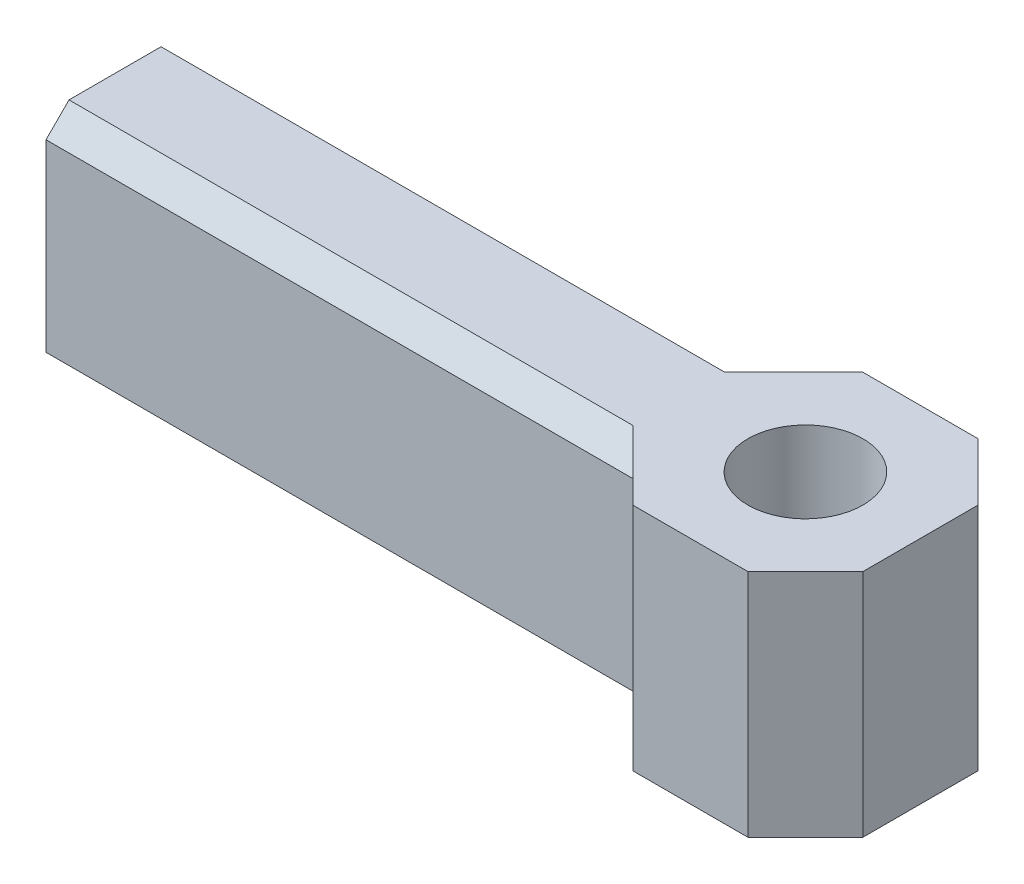
ISO-10303-21;
HEADER;
FILE_DESCRIPTION(('STEP AP214'),'2;1');
FILE_NAME('part.step','',(''),(''),'','','');
FILE_SCHEMA(('AUTOMOTIVE_DESIGN { 1 0 10303 214 1 1 1 1 }'));
ENDSEC;
DATA;
#1=APPLICATION_CONTEXT('core data for automotive mechanical design processes');
#2=APPLICATION_PROTOCOL_DEFINITION('international standard','automotive_design',2000,#1);
#3=PRODUCT_CONTEXT('',#1,'mechanical');
#4=PRODUCT('Part','Part','',(#3));
#5=PRODUCT_RELATED_PRODUCT_CATEGORY('part','',(#4));
#6=PRODUCT_DEFINITION_FORMATION('','',#4);
#7=PRODUCT_DEFINITION_CONTEXT('part definition',#1,'design');
#8=PRODUCT_DEFINITION('design','',#6,#7);
#9=PRODUCT_DEFINITION_SHAPE('','',#8);
#10=(LENGTH_UNIT() NAMED_UNIT(*) SI_UNIT(.MILLI.,.METRE.));
#11=(NAMED_UNIT(*) PLANE_ANGLE_UNIT() SI_UNIT($,.RADIAN.));
#12=(NAMED_UNIT(*) SI_UNIT($,.STERADIAN.) SOLID_ANGLE_UNIT());
#13=UNCERTAINTY_MEASURE_WITH_UNIT(LENGTH_MEASURE(1.E-05),#10,'distance_accuracy_value','');
#14=(GEOMETRIC_REPRESENTATION_CONTEXT(3) GLOBAL_UNCERTAINTY_ASSIGNED_CONTEXT((#13)) GLOBAL_UNIT_ASSIGNED_CONTEXT((#10,
#11,#12)) REPRESENTATION_CONTEXT('',''));
#15=CARTESIAN_POINT('',(0.,0.,0.));
#16=DIRECTION('',(0.,0.,1.));
#17=DIRECTION('',(1.,0.,0.));
#18=AXIS2_PLACEMENT_3D('',#15,#16,#17);
#19=CARTESIAN_POINT('',(5.,10.,5.));
#20=DIRECTION('',(-1.,0.,0.));
#21=DIRECTION('',(0.,0.,1.));
#22=AXIS2_PLACEMENT_3D('',#19,#20,#21);
#23=PLANE('',#22);
#24=DIRECTION('',(0.,0.,-1.));
#25=VECTOR('',#24,1.);
#26=CARTESIAN_POINT('',(5.,0.,5.));
#27=LINE('',#26,#25);
#28=CARTESIAN_POINT('',(5.,0.,2.5));
#29=VERTEX_POINT('',#28);
#30=CARTESIAN_POINT('',(5.,0.,-2.49999999999999));
#31=VERTEX_POINT('',#30);
#32=EDGE_CURVE('E162',#29,#31,#27,.T.);
#33=ORIENTED_EDGE('',*,*,#32,.T.);
#34=DIRECTION('',(0.,1.,0.));
#35=VECTOR('',#34,1.);
#36=CARTESIAN_POINT('',(5.,10.,-2.49999999999999));
#37=LINE('',#36,#35);
#38=CARTESIAN_POINT('',(5.,10.,-2.49999999999999));
#39=VERTEX_POINT('',#38);
#40=EDGE_CURVE('E139',#31,#39,#37,.T.);
#41=ORIENTED_EDGE('',*,*,#40,.T.);
#42=DIRECTION('',(0.,0.,-1.));
#43=VECTOR('',#42,1.);
#44=CARTESIAN_POINT('',(5.,10.,5.));
#45=LINE('',#44,#43);
#46=CARTESIAN_POINT('',(5.,10.,2.5));
#47=VERTEX_POINT('',#46);
#48=EDGE_CURVE('E173',#47,#39,#45,.T.);
#49=ORIENTED_EDGE('',*,*,#48,.F.);
#50=DIRECTION('',(0.,-1.,0.));
#51=VECTOR('',#50,1.);
#52=CARTESIAN_POINT('',(5.,10.,2.5));
#53=LINE('',#52,#51);
#54=EDGE_CURVE('E144',#47,#29,#53,.T.);
#55=ORIENTED_EDGE('',*,*,#54,.T.);
#56=EDGE_LOOP('',(#33,#41,#49,#55));
#57=FACE_BOUND('',#56,.T.);
#58=ADVANCED_FACE('F33',(#57),#23,.F.);
#59=CARTESIAN_POINT('',(-5.,10.,-5.));
#60=DIRECTION('',(0.,0.,1.));
#61=DIRECTION('',(1.,0.,0.));
#62=AXIS2_PLACEMENT_3D('',#59,#60,#61);
#63=PLANE('',#62);
#64=DIRECTION('',(-1.,0.,0.));
#65=VECTOR('',#64,1.);
#66=CARTESIAN_POINT('',(-5.,10.,-5.));
#67=LINE('',#66,#65);
#68=CARTESIAN_POINT('',(2.5,10.,-5.));
#69=VERTEX_POINT('',#68);
#70=CARTESIAN_POINT('',(-2.49999999999999,10.,-5.));
#71=VERTEX_POINT('',#70);
#72=EDGE_CURVE('E155',#69,#71,#67,.T.);
#73=ORIENTED_EDGE('',*,*,#72,.F.);
#74=DIRECTION('',(0.,-1.,0.));
#75=VECTOR('',#74,1.);
#76=CARTESIAN_POINT('',(2.5,10.,-5.));
#77=LINE('',#76,#75);
#78=CARTESIAN_POINT('',(2.5,0.,-5.));
#79=VERTEX_POINT('',#78);
#80=EDGE_CURVE('E138',#69,#79,#77,.T.);
#81=ORIENTED_EDGE('',*,*,#80,.T.);
#82=DIRECTION('',(-1.,0.,0.));
#83=VECTOR('',#82,1.);
#84=CARTESIAN_POINT('',(-5.,0.,-5.));
#85=LINE('',#84,#83);
#86=CARTESIAN_POINT('',(-2.49999999999999,0.,-5.));
#87=VERTEX_POINT('',#86);
#88=EDGE_CURVE('E152',#79,#87,#85,.T.);
#89=ORIENTED_EDGE('',*,*,#88,.T.);
#90=DIRECTION('',(0.,1.,0.));
#91=VECTOR('',#90,1.);
#92=CARTESIAN_POINT('',(-2.49999999999999,10.,-5.));
#93=LINE('',#92,#91);
#94=EDGE_CURVE('E157',#87,#71,#93,.T.);
#95=ORIENTED_EDGE('',*,*,#94,.T.);
#96=EDGE_LOOP('',(#73,#81,#89,#95));
#97=FACE_BOUND('',#96,.T.);
#98=ADVANCED_FACE('F150',(#97),#63,.F.);
#99=CARTESIAN_POINT('',(-5.00000000000001,10.,-3.));
#100=DIRECTION('',(0.,0.,1.));
#101=DIRECTION('',(1.,0.,0.));
#102=AXIS2_PLACEMENT_3D('',#99,#100,#101);
#103=PLANE('',#102);
#104=DIRECTION('',(0.,1.,0.));
#105=VECTOR('',#104,1.);
#106=CARTESIAN_POINT('',(-4.49999999999997,10.,-3.));
#107=LINE('',#106,#105);
#108=CARTESIAN_POINT('',(-4.49999999999997,8.99999999999999,-3.));
#109=VERTEX_POINT('',#108);
#110=CARTESIAN_POINT('',(-4.49999999999997,0.999999999999997,-3.));
#111=VERTEX_POINT('',#110);
#112=EDGE_CURVE('E205',#109,#111,#107,.F.);
#113=ORIENTED_EDGE('',*,*,#112,.T.);
#114=DIRECTION('',(-1.,0.,0.));
#115=VECTOR('',#114,1.);
#116=CARTESIAN_POINT('',(-30.,0.999999999999997,-3.));
#117=LINE('',#116,#115);
#118=CARTESIAN_POINT('',(-30.,0.999999999999997,-3.));
#119=VERTEX_POINT('',#118);
#120=EDGE_CURVE('E231',#111,#119,#117,.T.);
#121=ORIENTED_EDGE('',*,*,#120,.T.);
#122=DIRECTION('',(0.,-1.,0.));
#123=VECTOR('',#122,1.);
#124=CARTESIAN_POINT('',(-30.,10.,-3.));
#125=LINE('',#124,#123);
#126=CARTESIAN_POINT('',(-30.,8.99999999999999,-3.));
#127=VERTEX_POINT('',#126);
#128=EDGE_CURVE('E177',#127,#119,#125,.T.);
#129=ORIENTED_EDGE('',*,*,#128,.F.);
#130=DIRECTION('',(1.,0.,0.));
#131=VECTOR('',#130,1.);
#132=CARTESIAN_POINT('',(-5.00000000000001,8.99999999999999,-3.));
#133=LINE('',#132,#131);
#134=EDGE_CURVE('E54',#127,#109,#133,.T.);
#135=ORIENTED_EDGE('',*,*,#134,.T.);
#136=EDGE_LOOP('',(#113,#121,#129,#135));
#137=FACE_BOUND('',#136,.T.);
#138=ADVANCED_FACE('F288',(#137),#103,.F.);
#139=CARTESIAN_POINT('',(-30.,10.,-3.));
#140=DIRECTION('',(1.,0.,0.));
#141=DIRECTION('',(0.,0.,-1.));
#142=AXIS2_PLACEMENT_3D('',#139,#140,#141);
#143=PLANE('',#142);
#144=CARTESIAN_POINT('',(-30.,5.,0.));
#145=DIRECTION('',(-1.,0.,0.));
#146=DIRECTION('',(0.,0.,1.));
#147=AXIS2_PLACEMENT_3D('',#144,#145,#146);
#148=CIRCLE('',#147,1.7);
#149=CARTESIAN_POINT('',(-30.,5.,1.7));
#150=VERTEX_POINT('',#149);
#151=EDGE_CURVE('E272',#150,#150,#148,.T.);
#152=ORIENTED_EDGE('',*,*,#151,.F.);
#153=EDGE_LOOP('',(#152));
#154=FACE_BOUND('',#153,.T.);
#155=DIRECTION('',(0.,0.,1.));
#156=VECTOR('',#155,1.);
#157=CARTESIAN_POINT('',(-30.,0.,-3.));
#158=LINE('',#157,#156);
#159=CARTESIAN_POINT('',(-30.,0.,-1.99999999999999));
#160=VERTEX_POINT('',#159);
#161=CARTESIAN_POINT('',(-30.,0.,2.));
#162=VERTEX_POINT('',#161);
#163=EDGE_CURVE('E161',#160,#162,#158,.T.);
#164=ORIENTED_EDGE('',*,*,#163,.T.);
#165=DIRECTION('',(0.,0.707106781186546,0.707106781186549));
#166=VECTOR('',#165,1.);
#167=CARTESIAN_POINT('',(-30.,1.,3.00000000000001));
#168=LINE('',#167,#166);
#169=CARTESIAN_POINT('',(-30.,1.,3.00000000000001));
#170=VERTEX_POINT('',#169);
#171=EDGE_CURVE('E222',#162,#170,#168,.T.);
#172=ORIENTED_EDGE('',*,*,#171,.T.);
#173=DIRECTION('',(0.,-1.,0.));
#174=VECTOR('',#173,1.);
#175=CARTESIAN_POINT('',(-30.,10.,3.00000000000001));
#176=LINE('',#175,#174);
#177=CARTESIAN_POINT('',(-30.,8.99999999999999,3.00000000000001));
#178=VERTEX_POINT('',#177);
#179=EDGE_CURVE('E174',#178,#170,#176,.T.);
#180=ORIENTED_EDGE('',*,*,#179,.F.);
#181=DIRECTION('',(0.,-0.707106781186549,0.707106781186546));
#182=VECTOR('',#181,1.);
#183=CARTESIAN_POINT('',(-30.,10.,2.));
#184=LINE('',#183,#182);
#185=CARTESIAN_POINT('',(-30.,10.,2.));
#186=VERTEX_POINT('',#185);
#187=EDGE_CURVE('E220',#178,#186,#184,.F.);
#188=ORIENTED_EDGE('',*,*,#187,.T.);
#189=DIRECTION('',(0.,0.,1.));
#190=VECTOR('',#189,1.);
#191=CARTESIAN_POINT('',(-30.,10.,-3.));
#192=LINE('',#191,#190);
#193=CARTESIAN_POINT('',(-30.,10.,-1.99999999999999));
#194=VERTEX_POINT('',#193);
#195=EDGE_CURVE('E256',#194,#186,#192,.T.);
#196=ORIENTED_EDGE('',*,*,#195,.F.);
#197=DIRECTION('',(0.,0.707106781186549,0.707106781186546));
#198=VECTOR('',#197,1.);
#199=CARTESIAN_POINT('',(-30.,10.,-1.99999999999999));
#200=LINE('',#199,#198);
#201=EDGE_CURVE('E216',#194,#127,#200,.F.);
#202=ORIENTED_EDGE('',*,*,#201,.T.);
#203=ORIENTED_EDGE('',*,*,#128,.T.);
#204=DIRECTION('',(0.,-0.707106781186545,0.70710678118655));
#205=VECTOR('',#204,1.);
#206=CARTESIAN_POINT('',(-30.,0.999999999999997,-3.));
#207=LINE('',#206,#205);
#208=EDGE_CURVE('E218',#119,#160,#207,.T.);
#209=ORIENTED_EDGE('',*,*,#208,.T.);
#210=EDGE_LOOP('',(#164,#172,#180,#188,#196,#202,#203,#209));
#211=FACE_BOUND('',#210,.T.);
#212=ADVANCED_FACE('F255',(#154,#211),#143,.F.);
#213=CARTESIAN_POINT('',(-30.,10.,3.00000000000001));
#214=DIRECTION('',(0.,0.,-1.));
#215=DIRECTION('',(-1.,0.,0.));
#216=AXIS2_PLACEMENT_3D('',#213,#214,#215);
#217=PLANE('',#216);
#218=ORIENTED_EDGE('',*,*,#179,.T.);
#219=DIRECTION('',(1.,0.,0.));
#220=VECTOR('',#219,1.);
#221=CARTESIAN_POINT('',(-4.49999999999998,1.,3.));
#222=LINE('',#221,#220);
#223=CARTESIAN_POINT('',(-4.49999999999998,1.,3.));
#224=VERTEX_POINT('',#223);
#225=EDGE_CURVE('E209',#170,#224,#222,.T.);
#226=ORIENTED_EDGE('',*,*,#225,.T.);
#227=DIRECTION('',(0.,-1.,0.));
#228=VECTOR('',#227,1.);
#229=CARTESIAN_POINT('',(-4.49999999999998,10.,3.));
#230=LINE('',#229,#228);
#231=CARTESIAN_POINT('',(-4.49999999999998,8.99999999999999,3.));
#232=VERTEX_POINT('',#231);
#233=EDGE_CURVE('E202',#224,#232,#230,.F.);
#234=ORIENTED_EDGE('',*,*,#233,.T.);
#235=DIRECTION('',(-1.,0.,0.));
#236=VECTOR('',#235,1.);
#237=CARTESIAN_POINT('',(-30.,8.99999999999999,3.00000000000001));
#238=LINE('',#237,#236);
#239=EDGE_CURVE('E207',#232,#178,#238,.T.);
#240=ORIENTED_EDGE('',*,*,#239,.T.);
#241=EDGE_LOOP('',(#218,#226,#234,#240));
#242=FACE_BOUND('',#241,.T.);
#243=ADVANCED_FACE('F247',(#242),#217,.F.);
#244=CARTESIAN_POINT('',(-5.,10.,5.));
#245=DIRECTION('',(0.,0.,-1.));
#246=DIRECTION('',(-1.,0.,0.));
#247=AXIS2_PLACEMENT_3D('',#244,#245,#246);
#248=PLANE('',#247);
#249=DIRECTION('',(1.,0.,0.));
#250=VECTOR('',#249,1.);
#251=CARTESIAN_POINT('',(-5.,0.,5.));
#252=LINE('',#251,#250);
#253=CARTESIAN_POINT('',(-2.49999999999995,0.,5.));
#254=VERTEX_POINT('',#253);
#255=CARTESIAN_POINT('',(2.49999999999999,0.,5.));
#256=VERTEX_POINT('',#255);
#257=EDGE_CURVE('E165',#254,#256,#252,.T.);
#258=ORIENTED_EDGE('',*,*,#257,.T.);
#259=DIRECTION('',(0.,1.,0.));
#260=VECTOR('',#259,1.);
#261=CARTESIAN_POINT('',(2.49999999999999,10.,5.));
#262=LINE('',#261,#260);
#263=CARTESIAN_POINT('',(2.49999999999999,10.,5.));
#264=VERTEX_POINT('',#263);
#265=EDGE_CURVE('E200',#256,#264,#262,.T.);
#266=ORIENTED_EDGE('',*,*,#265,.T.);
#267=DIRECTION('',(1.,0.,0.));
#268=VECTOR('',#267,1.);
#269=CARTESIAN_POINT('',(-5.,10.,5.));
#270=LINE('',#269,#268);
#271=CARTESIAN_POINT('',(-2.49999999999995,10.,5.));
#272=VERTEX_POINT('',#271);
#273=EDGE_CURVE('E178',#272,#264,#270,.T.);
#274=ORIENTED_EDGE('',*,*,#273,.F.);
#275=DIRECTION('',(0.,-1.,0.));
#276=VECTOR('',#275,1.);
#277=CARTESIAN_POINT('',(-2.49999999999995,10.,5.));
#278=LINE('',#277,#276);
#279=EDGE_CURVE('E197',#272,#254,#278,.T.);
#280=ORIENTED_EDGE('',*,*,#279,.T.);
#281=EDGE_LOOP('',(#258,#266,#274,#280));
#282=FACE_BOUND('',#281,.T.);
#283=ADVANCED_FACE('F294',(#282),#248,.F.);
#284=CARTESIAN_POINT('',(0.,10.,0.));
#285=DIRECTION('',(0.,-1.,0.));
#286=DIRECTION('',(0.,0.,-1.));
#287=AXIS2_PLACEMENT_3D('',#284,#285,#286);
#288=PLANE('',#287);
#289=CARTESIAN_POINT('',(0.,10.,0.));
#290=DIRECTION('',(0.,1.,0.));
#291=DIRECTION('',(0.,0.,1.));
#292=AXIS2_PLACEMENT_3D('',#289,#290,#291);
#293=CIRCLE('',#292,2.5);
#294=CARTESIAN_POINT('',(0.,10.,2.5));
#295=VERTEX_POINT('',#294);
#296=EDGE_CURVE('E266',#295,#295,#293,.T.);
#297=ORIENTED_EDGE('',*,*,#296,.F.);
#298=EDGE_LOOP('',(#297));
#299=FACE_BOUND('',#298,.T.);
#300=ORIENTED_EDGE('',*,*,#195,.T.);
#301=DIRECTION('',(1.,0.,0.));
#302=VECTOR('',#301,1.);
#303=CARTESIAN_POINT('',(0.,10.,2.));
#304=LINE('',#303,#302);
#305=CARTESIAN_POINT('',(-5.5,10.,2.));
#306=VERTEX_POINT('',#305);
#307=EDGE_CURVE('E227',#186,#306,#304,.T.);
#308=ORIENTED_EDGE('',*,*,#307,.T.);
#309=DIRECTION('',(-0.707106781186553,0.,-0.707106781186542));
#310=VECTOR('',#309,1.);
#311=CARTESIAN_POINT('',(-2.49999999999995,10.,5.));
#312=LINE('',#311,#310);
#313=EDGE_CURVE('E191',#306,#272,#312,.F.);
#314=ORIENTED_EDGE('',*,*,#313,.T.);
#315=ORIENTED_EDGE('',*,*,#273,.T.);
#316=DIRECTION('',(-0.707106781186548,0.,0.707106781186547));
#317=VECTOR('',#316,1.);
#318=CARTESIAN_POINT('',(5.,10.,2.5));
#319=LINE('',#318,#317);
#320=EDGE_CURVE('E193',#264,#47,#319,.F.);
#321=ORIENTED_EDGE('',*,*,#320,.T.);
#322=ORIENTED_EDGE('',*,*,#48,.T.);
#323=DIRECTION('',(0.707106781186547,0.,0.707106781186549));
#324=VECTOR('',#323,1.);
#325=CARTESIAN_POINT('',(2.5,10.,-5.));
#326=LINE('',#325,#324);
#327=EDGE_CURVE('E195',#39,#69,#326,.F.);
#328=ORIENTED_EDGE('',*,*,#327,.T.);
#329=ORIENTED_EDGE('',*,*,#72,.T.);
#330=DIRECTION('',(0.707106781186544,0.,-0.707106781186551));
#331=VECTOR('',#330,1.);
#332=CARTESIAN_POINT('',(-5.00000000000001,10.,-2.49999999999995));
#333=LINE('',#332,#331);
#334=CARTESIAN_POINT('',(-5.49999999999996,10.,-1.99999999999999));
#335=VERTEX_POINT('',#334);
#336=EDGE_CURVE('E189',#71,#335,#333,.F.);
#337=ORIENTED_EDGE('',*,*,#336,.T.);
#338=DIRECTION('',(-1.,0.,0.));
#339=VECTOR('',#338,1.);
#340=CARTESIAN_POINT('',(0.,10.,-1.99999999999999));
#341=LINE('',#340,#339);
#342=EDGE_CURVE('E224',#335,#194,#341,.T.);
#343=ORIENTED_EDGE('',*,*,#342,.T.);
#344=EDGE_LOOP('',(#300,#308,#314,#315,#321,#322,#328,#329,#337,#343));
#345=FACE_BOUND('',#344,.T.);
#346=ADVANCED_FACE('F258',(#299,#345),#288,.F.);
#347=CARTESIAN_POINT('',(0.,0.,0.));
#348=DIRECTION('',(0.,-1.,0.));
#349=DIRECTION('',(0.,0.,-1.));
#350=AXIS2_PLACEMENT_3D('',#347,#348,#349);
#351=PLANE('',#350);
#352=CARTESIAN_POINT('',(0.,0.,0.));
#353=DIRECTION('',(0.,1.,0.));
#354=DIRECTION('',(0.,0.,1.));
#355=AXIS2_PLACEMENT_3D('',#352,#353,#354);
#356=CIRCLE('',#355,2.5);
#357=CARTESIAN_POINT('',(0.,0.,2.5));
#358=VERTEX_POINT('',#357);
#359=EDGE_CURVE('E167',#358,#358,#356,.T.);
#360=ORIENTED_EDGE('',*,*,#359,.T.);
#361=EDGE_LOOP('',(#360));
#362=FACE_BOUND('',#361,.T.);
#363=DIRECTION('',(0.707106781186553,0.,0.707106781186542));
#364=VECTOR('',#363,1.);
#365=CARTESIAN_POINT('',(-3.74999999999996,0.,3.75000000000002));
#366=LINE('',#365,#364);
#367=CARTESIAN_POINT('',(-5.50000000000001,0.,2.));
#368=VERTEX_POINT('',#367);
#369=EDGE_CURVE('E183',#254,#368,#366,.F.);
#370=ORIENTED_EDGE('',*,*,#369,.T.);
#371=DIRECTION('',(-1.,0.,0.));
#372=VECTOR('',#371,1.);
#373=CARTESIAN_POINT('',(-30.,0.,2.));
#374=LINE('',#373,#372);
#375=EDGE_CURVE('E214',#368,#162,#374,.T.);
#376=ORIENTED_EDGE('',*,*,#375,.T.);
#377=ORIENTED_EDGE('',*,*,#163,.F.);
#378=DIRECTION('',(1.,0.,0.));
#379=VECTOR('',#378,1.);
#380=CARTESIAN_POINT('',(-4.49999999999997,0.,-1.99999999999999));
#381=LINE('',#380,#379);
#382=CARTESIAN_POINT('',(-5.49999999999996,0.,-1.99999999999999));
#383=VERTEX_POINT('',#382);
#384=EDGE_CURVE('E212',#160,#383,#381,.T.);
#385=ORIENTED_EDGE('',*,*,#384,.T.);
#386=DIRECTION('',(-0.707106781186544,0.,0.707106781186551));
#387=VECTOR('',#386,1.);
#388=CARTESIAN_POINT('',(-3.75000000000001,0.,-3.74999999999997));
#389=LINE('',#388,#387);
#390=EDGE_CURVE('E156',#383,#87,#389,.F.);
#391=ORIENTED_EDGE('',*,*,#390,.T.);
#392=ORIENTED_EDGE('',*,*,#88,.F.);
#393=DIRECTION('',(-0.707106781186547,0.,-0.707106781186549));
#394=VECTOR('',#393,1.);
#395=CARTESIAN_POINT('',(3.75,0.,-3.74999999999999));
#396=LINE('',#395,#394);
#397=EDGE_CURVE('E134',#79,#31,#396,.F.);
#398=ORIENTED_EDGE('',*,*,#397,.T.);
#399=ORIENTED_EDGE('',*,*,#32,.F.);
#400=DIRECTION('',(0.707106781186548,0.,-0.707106781186547));
#401=VECTOR('',#400,1.);
#402=CARTESIAN_POINT('',(3.74999999999999,0.,3.75));
#403=LINE('',#402,#401);
#404=EDGE_CURVE('E145',#29,#256,#403,.F.);
#405=ORIENTED_EDGE('',*,*,#404,.T.);
#406=ORIENTED_EDGE('',*,*,#257,.F.);
#407=EDGE_LOOP('',(#370,#376,#377,#385,#391,#392,#398,#399,#405,#406));
#408=FACE_BOUND('',#407,.T.);
#409=ADVANCED_FACE('F159',(#362,#408),#351,.T.);
#410=CARTESIAN_POINT('',(0.,0.,0.));
#411=DIRECTION('',(0.,1.,0.));
#412=DIRECTION('',(0.,0.,1.));
#413=AXIS2_PLACEMENT_3D('',#410,#411,#412);
#414=CYLINDRICAL_SURFACE('',#413,2.5);
#415=ORIENTED_EDGE('',*,*,#359,.F.);
#416=EDGE_LOOP('',(#415));
#417=FACE_BOUND('',#416,.T.);
#418=ORIENTED_EDGE('',*,*,#296,.T.);
#419=EDGE_LOOP('',(#418));
#420=FACE_BOUND('',#419,.T.);
#421=ADVANCED_FACE('F283',(#417,#420),#414,.F.);
#422=CARTESIAN_POINT('',(-10.,5.,0.));
#423=DIRECTION('',(-1.,0.,0.));
#424=DIRECTION('',(0.,0.,1.));
#425=AXIS2_PLACEMENT_3D('',#422,#423,#424);
#426=CYLINDRICAL_SURFACE('',#425,1.7);
#427=CARTESIAN_POINT('',(-10.,5.,0.));
#428=DIRECTION('',(-1.,0.,0.));
#429=DIRECTION('',(0.,0.,1.));
#430=AXIS2_PLACEMENT_3D('',#427,#428,#429);
#431=CIRCLE('',#430,1.7);
#432=CARTESIAN_POINT('',(-10.,5.,1.7));
#433=VERTEX_POINT('',#432);
#434=EDGE_CURVE('E269',#433,#433,#431,.T.);
#435=ORIENTED_EDGE('',*,*,#434,.F.);
#436=EDGE_LOOP('',(#435));
#437=FACE_BOUND('',#436,.T.);
#438=ORIENTED_EDGE('',*,*,#151,.T.);
#439=EDGE_LOOP('',(#438));
#440=FACE_BOUND('',#439,.T.);
#441=ADVANCED_FACE('F280',(#437,#440),#426,.F.);
#442=CARTESIAN_POINT('',(-10.,5.,0.));
#443=DIRECTION('',(-1.,0.,0.));
#444=DIRECTION('',(0.,0.,1.));
#445=AXIS2_PLACEMENT_3D('',#442,#443,#444);
#446=PLANE('',#445);
#447=ORIENTED_EDGE('',*,*,#434,.T.);
#448=EDGE_LOOP('',(#447));
#449=FACE_BOUND('',#448,.T.);
#450=ADVANCED_FACE('F278',(#449),#446,.T.);
#451=CARTESIAN_POINT('',(2.5,10.,-5.));
#452=DIRECTION('',(-0.707106781186549,0.,0.707106781186547));
#453=DIRECTION('',(0.,-1.,0.));
#454=AXIS2_PLACEMENT_3D('',#451,#452,#453);
#455=PLANE('',#454);
#456=ORIENTED_EDGE('',*,*,#327,.F.);
#457=ORIENTED_EDGE('',*,*,#40,.F.);
#458=ORIENTED_EDGE('',*,*,#397,.F.);
#459=ORIENTED_EDGE('',*,*,#80,.F.);
#460=EDGE_LOOP('',(#456,#457,#458,#459));
#461=FACE_BOUND('',#460,.T.);
#462=ADVANCED_FACE('F137',(#461),#455,.F.);
#463=CARTESIAN_POINT('',(5.,10.,2.5));
#464=DIRECTION('',(-0.707106781186547,0.,-0.707106781186548));
#465=DIRECTION('',(0.,-1.,0.));
#466=AXIS2_PLACEMENT_3D('',#463,#464,#465);
#467=PLANE('',#466);
#468=ORIENTED_EDGE('',*,*,#320,.F.);
#469=ORIENTED_EDGE('',*,*,#265,.F.);
#470=ORIENTED_EDGE('',*,*,#404,.F.);
#471=ORIENTED_EDGE('',*,*,#54,.F.);
#472=EDGE_LOOP('',(#468,#469,#470,#471));
#473=FACE_BOUND('',#472,.T.);
#474=ADVANCED_FACE('F307',(#473),#467,.F.);
#475=CARTESIAN_POINT('',(-2.49999999999995,10.,5.));
#476=DIRECTION('',(0.707106781186542,0.,-0.707106781186553));
#477=DIRECTION('',(0.,-1.,0.));
#478=AXIS2_PLACEMENT_3D('',#475,#476,#477);
#479=PLANE('',#478);
#480=ORIENTED_EDGE('',*,*,#313,.F.);
#481=DIRECTION('',(0.577350269189631,-0.577350269189624,0.577350269189622));
#482=VECTOR('',#481,1.);
#483=CARTESIAN_POINT('',(-3.66666666666663,8.16666666666665,3.83333333333334));
#484=LINE('',#483,#482);
#485=EDGE_CURVE('E237',#306,#232,#484,.T.);
#486=ORIENTED_EDGE('',*,*,#485,.T.);
#487=ORIENTED_EDGE('',*,*,#233,.F.);
#488=DIRECTION('',(0.577350269189633,0.577350269189621,0.577350269189623));
#489=VECTOR('',#488,1.);
#490=CARTESIAN_POINT('',(-13.0000000000002,-7.50000000000004,-5.50000000000007));
#491=LINE('',#490,#489);
#492=EDGE_CURVE('E234',#224,#368,#491,.F.);
#493=ORIENTED_EDGE('',*,*,#492,.T.);
#494=ORIENTED_EDGE('',*,*,#369,.F.);
#495=ORIENTED_EDGE('',*,*,#279,.F.);
#496=EDGE_LOOP('',(#480,#486,#487,#493,#494,#495));
#497=FACE_BOUND('',#496,.T.);
#498=ADVANCED_FACE('F241',(#497),#479,.F.);
#499=CARTESIAN_POINT('',(-5.00000000000001,10.,-2.49999999999995));
#500=DIRECTION('',(0.707106781186551,0.,0.707106781186544));
#501=DIRECTION('',(0.,-1.,0.));
#502=AXIS2_PLACEMENT_3D('',#499,#500,#501);
#503=PLANE('',#502);
#504=ORIENTED_EDGE('',*,*,#336,.F.);
#505=ORIENTED_EDGE('',*,*,#94,.F.);
#506=ORIENTED_EDGE('',*,*,#390,.F.);
#507=DIRECTION('',(-0.577350269189623,-0.577350269189625,0.577350269189629));
#508=VECTOR('',#507,1.);
#509=CARTESIAN_POINT('',(-4.66666666666665,0.833333333333319,-2.83333333333332));
#510=LINE('',#509,#508);
#511=EDGE_CURVE('E41',#383,#111,#510,.F.);
#512=ORIENTED_EDGE('',*,*,#511,.T.);
#513=ORIENTED_EDGE('',*,*,#112,.F.);
#514=DIRECTION('',(-0.577350269189621,0.577350269189629,0.577350269189627));
#515=VECTOR('',#514,1.);
#516=CARTESIAN_POINT('',(-3.66666666666667,8.16666666666668,-3.8333333333333));
#517=LINE('',#516,#515);
#518=EDGE_CURVE('E11',#109,#335,#517,.T.);
#519=ORIENTED_EDGE('',*,*,#518,.T.);
#520=EDGE_LOOP('',(#504,#505,#506,#512,#513,#519));
#521=FACE_BOUND('',#520,.T.);
#522=ADVANCED_FACE('F313',(#521),#503,.F.);
#523=CARTESIAN_POINT('',(-30.,1.,3.00000000000001));
#524=DIRECTION('',(0.,-0.707106781186549,0.707106781186546));
#525=DIRECTION('',(-1.,0.,0.));
#526=AXIS2_PLACEMENT_3D('',#523,#524,#525);
#527=PLANE('',#526);
#528=ORIENTED_EDGE('',*,*,#171,.F.);
#529=ORIENTED_EDGE('',*,*,#375,.F.);
#530=ORIENTED_EDGE('',*,*,#492,.F.);
#531=ORIENTED_EDGE('',*,*,#225,.F.);
#532=EDGE_LOOP('',(#528,#529,#530,#531));
#533=FACE_BOUND('',#532,.T.);
#534=ADVANCED_FACE('F316',(#533),#527,.T.);
#535=CARTESIAN_POINT('',(0.,10.,2.));
#536=DIRECTION('',(0.,-0.707106781186546,-0.707106781186549));
#537=DIRECTION('',(1.,0.,0.));
#538=AXIS2_PLACEMENT_3D('',#535,#536,#537);
#539=PLANE('',#538);
#540=ORIENTED_EDGE('',*,*,#187,.F.);
#541=ORIENTED_EDGE('',*,*,#239,.F.);
#542=ORIENTED_EDGE('',*,*,#485,.F.);
#543=ORIENTED_EDGE('',*,*,#307,.F.);
#544=EDGE_LOOP('',(#540,#541,#542,#543));
#545=FACE_BOUND('',#544,.T.);
#546=ADVANCED_FACE('F251',(#545),#539,.F.);
#547=CARTESIAN_POINT('',(-5.00000000000001,0.999999999999997,-3.));
#548=DIRECTION('',(0.,-0.70710678118655,-0.707106781186545));
#549=DIRECTION('',(1.,0.,0.));
#550=AXIS2_PLACEMENT_3D('',#547,#548,#549);
#551=PLANE('',#550);
#552=ORIENTED_EDGE('',*,*,#511,.F.);
#553=ORIENTED_EDGE('',*,*,#384,.F.);
#554=ORIENTED_EDGE('',*,*,#208,.F.);
#555=ORIENTED_EDGE('',*,*,#120,.F.);
#556=EDGE_LOOP('',(#552,#553,#554,#555));
#557=FACE_BOUND('',#556,.T.);
#558=ADVANCED_FACE('F321',(#557),#551,.T.);
#559=CARTESIAN_POINT('',(0.,10.,-1.99999999999999));
#560=DIRECTION('',(0.,-0.707106781186546,0.707106781186549));
#561=DIRECTION('',(-1.,0.,0.));
#562=AXIS2_PLACEMENT_3D('',#559,#560,#561);
#563=PLANE('',#562);
#564=ORIENTED_EDGE('',*,*,#518,.F.);
#565=ORIENTED_EDGE('',*,*,#134,.F.);
#566=ORIENTED_EDGE('',*,*,#201,.F.);
#567=ORIENTED_EDGE('',*,*,#342,.F.);
#568=EDGE_LOOP('',(#564,#565,#566,#567));
#569=FACE_BOUND('',#568,.T.);
#570=ADVANCED_FACE('F35',(#569),#563,.F.);
#571=CLOSED_SHELL('',(#58,#98,#138,#212,#243,#283,#346,#409,#421,#441,#450,#462,#474,#498,#522,
#534,#546,#558,#570));
#572=MANIFOLD_SOLID_BREP('B2',#571);
#573=ADVANCED_BREP_SHAPE_REPRESENTATION('',(#18,#572),#14);
#574=SHAPE_DEFINITION_REPRESENTATION(#9,#573);
ENDSEC;
END-ISO-10303-21;
